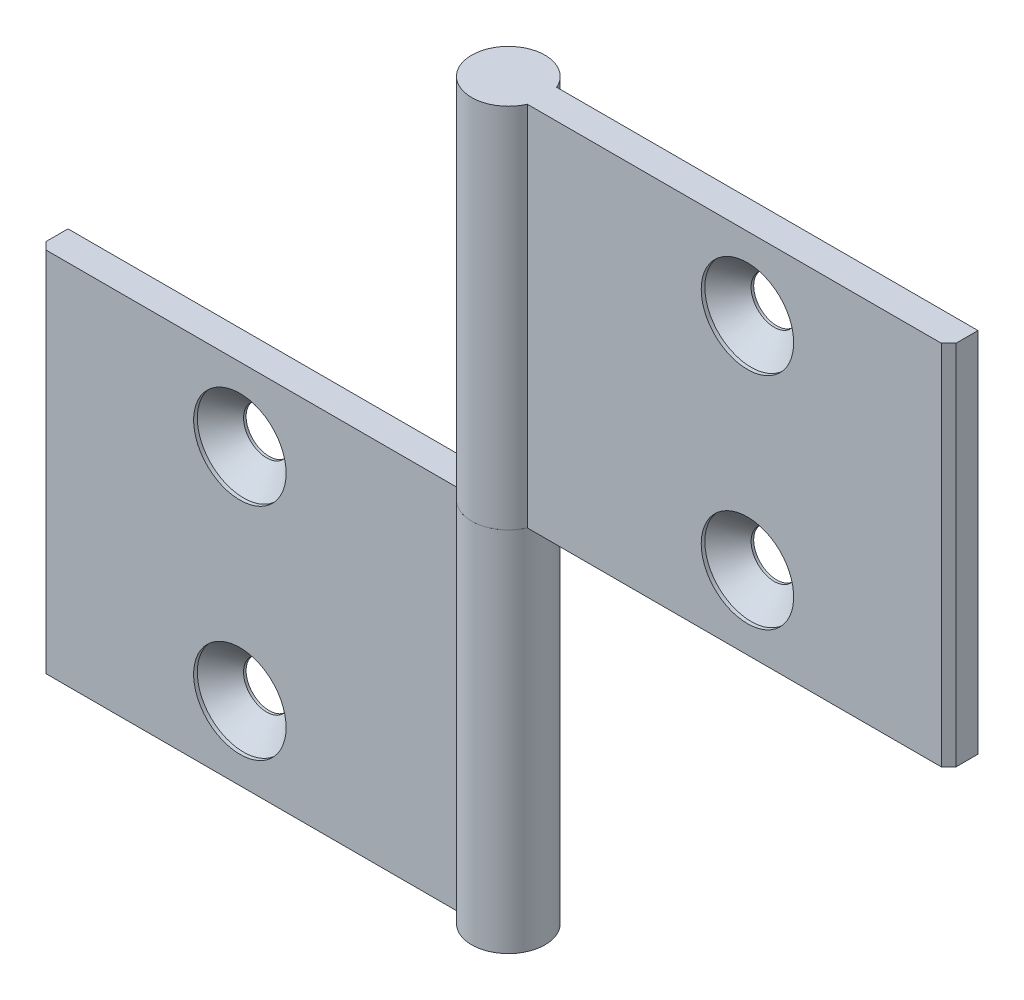
ISO-10303-21;
HEADER;
FILE_DESCRIPTION(('STEP AP214'),'2;1');
FILE_NAME('part.step','',(''),(''),'','','');
FILE_SCHEMA(('AUTOMOTIVE_DESIGN { 1 0 10303 214 1 1 1 1 }'));
ENDSEC;
DATA;
#1=APPLICATION_CONTEXT('core data for automotive mechanical design processes');
#2=APPLICATION_PROTOCOL_DEFINITION('international standard','automotive_design',2000,#1);
#3=PRODUCT_CONTEXT('',#1,'mechanical');
#4=PRODUCT('Part','Part','',(#3));
#5=PRODUCT_RELATED_PRODUCT_CATEGORY('part','',(#4));
#6=PRODUCT_DEFINITION_FORMATION('','',#4);
#7=PRODUCT_DEFINITION_CONTEXT('part definition',#1,'design');
#8=PRODUCT_DEFINITION('design','',#6,#7);
#9=PRODUCT_DEFINITION_SHAPE('','',#8);
#10=(LENGTH_UNIT() NAMED_UNIT(*) SI_UNIT(.MILLI.,.METRE.));
#11=(NAMED_UNIT(*) PLANE_ANGLE_UNIT() SI_UNIT($,.RADIAN.));
#12=(NAMED_UNIT(*) SI_UNIT($,.STERADIAN.) SOLID_ANGLE_UNIT());
#13=UNCERTAINTY_MEASURE_WITH_UNIT(LENGTH_MEASURE(1.E-05),#10,'distance_accuracy_value','');
#14=(GEOMETRIC_REPRESENTATION_CONTEXT(3) GLOBAL_UNCERTAINTY_ASSIGNED_CONTEXT((#13)) GLOBAL_UNIT_ASSIGNED_CONTEXT((#10,
#11,#12)) REPRESENTATION_CONTEXT('',''));
#15=CARTESIAN_POINT('',(0.,0.,0.));
#16=DIRECTION('',(0.,0.,1.));
#17=DIRECTION('',(1.,0.,0.));
#18=AXIS2_PLACEMENT_3D('',#15,#16,#17);
#19=CARTESIAN_POINT('',(0.,25.,0.));
#20=DIRECTION('',(0.,1.,0.));
#21=DIRECTION('',(0.,0.,-1.));
#22=AXIS2_PLACEMENT_3D('',#19,#20,#21);
#23=CYLINDRICAL_SURFACE('',#22,5.);
#24=CARTESIAN_POINT('',(0.,75.,0.));
#25=DIRECTION('',(0.,-1.,0.));
#26=DIRECTION('',(0.,0.,1.));
#27=AXIS2_PLACEMENT_3D('',#24,#25,#26);
#28=CIRCLE('',#27,5.);
#29=CARTESIAN_POINT('',(4.58257569495585,75.,1.99999999999997));
#30=VERTEX_POINT('',#29);
#31=CARTESIAN_POINT('',(4.58257569495582,75.,-2.00000000000004));
#32=VERTEX_POINT('',#31);
#33=EDGE_CURVE('E120',#30,#32,#28,.T.);
#34=ORIENTED_EDGE('',*,*,#33,.T.);
#35=DIRECTION('',(0.,1.,0.));
#36=VECTOR('',#35,1.);
#37=CARTESIAN_POINT('',(4.58257569495582,25.,-2.00000000000004));
#38=LINE('',#37,#36);
#39=CARTESIAN_POINT('',(4.58257569495582,25.,-2.00000000000004));
#40=VERTEX_POINT('',#39);
#41=EDGE_CURVE('E12',#40,#32,#38,.T.);
#42=ORIENTED_EDGE('',*,*,#41,.F.);
#43=CARTESIAN_POINT('',(0.,25.,0.));
#44=DIRECTION('',(0.,-1.,0.));
#45=DIRECTION('',(0.,0.,1.));
#46=AXIS2_PLACEMENT_3D('',#43,#44,#45);
#47=CIRCLE('',#46,5.);
#48=CARTESIAN_POINT('',(4.58257569495585,25.,1.99999999999997));
#49=VERTEX_POINT('',#48);
#50=EDGE_CURVE('E129',#49,#40,#47,.T.);
#51=ORIENTED_EDGE('',*,*,#50,.F.);
#52=DIRECTION('',(0.,1.,0.));
#53=VECTOR('',#52,1.);
#54=CARTESIAN_POINT('',(4.58257569495585,25.,1.99999999999997));
#55=LINE('',#54,#53);
#56=EDGE_CURVE('E116',#49,#30,#55,.T.);
#57=ORIENTED_EDGE('',*,*,#56,.T.);
#58=EDGE_LOOP('',(#34,#42,#51,#57));
#59=FACE_BOUND('',#58,.T.);
#60=ADVANCED_FACE('F44',(#59),#23,.T.);
#61=CARTESIAN_POINT('',(4.58257569495582,25.,-2.00000000000004));
#62=DIRECTION('',(0.,0.,1.));
#63=DIRECTION('',(-1.,0.,0.));
#64=AXIS2_PLACEMENT_3D('',#61,#62,#63);
#65=PLANE('',#64);
#66=CARTESIAN_POINT('',(34.5825756949558,35.,-2.00000000000025));
#67=DIRECTION('',(0.,0.,1.));
#68=DIRECTION('',(-1.,0.,0.));
#69=AXIS2_PLACEMENT_3D('',#66,#67,#68);
#70=CIRCLE('',#69,3.15);
#71=CARTESIAN_POINT('',(31.4325756949558,35.,-2.00000000000023));
#72=VERTEX_POINT('',#71);
#73=EDGE_CURVE('E47',#72,#72,#70,.T.);
#74=ORIENTED_EDGE('',*,*,#73,.T.);
#75=EDGE_LOOP('',(#74));
#76=FACE_BOUND('',#75,.T.);
#77=CARTESIAN_POINT('',(34.5825756949558,65.,-2.00000000000025));
#78=DIRECTION('',(0.,0.,1.));
#79=DIRECTION('',(-1.,0.,0.));
#80=AXIS2_PLACEMENT_3D('',#77,#78,#79);
#81=CIRCLE('',#80,3.15);
#82=CARTESIAN_POINT('',(31.4325756949558,65.,-2.00000000000023));
#83=VERTEX_POINT('',#82);
#84=EDGE_CURVE('E124',#83,#83,#81,.T.);
#85=ORIENTED_EDGE('',*,*,#84,.T.);
#86=EDGE_LOOP('',(#85));
#87=FACE_BOUND('',#86,.T.);
#88=DIRECTION('',(1.,0.,0.));
#89=VECTOR('',#88,1.);
#90=CARTESIAN_POINT('',(4.58257569495582,75.,-2.00000000000004));
#91=LINE('',#90,#89);
#92=CARTESIAN_POINT('',(62.,75.,-2.00000000000046));
#93=VERTEX_POINT('',#92);
#94=EDGE_CURVE('E123',#32,#93,#91,.T.);
#95=ORIENTED_EDGE('',*,*,#94,.T.);
#96=DIRECTION('',(0.,1.,0.));
#97=VECTOR('',#96,1.);
#98=CARTESIAN_POINT('',(62.,25.,-2.00000000000046));
#99=LINE('',#98,#97);
#100=CARTESIAN_POINT('',(62.,25.,-2.00000000000046));
#101=VERTEX_POINT('',#100);
#102=EDGE_CURVE('E53',#101,#93,#99,.T.);
#103=ORIENTED_EDGE('',*,*,#102,.F.);
#104=DIRECTION('',(1.,0.,0.));
#105=VECTOR('',#104,1.);
#106=CARTESIAN_POINT('',(4.58257569495582,25.,-2.00000000000004));
#107=LINE('',#106,#105);
#108=EDGE_CURVE('E96',#40,#101,#107,.T.);
#109=ORIENTED_EDGE('',*,*,#108,.F.);
#110=ORIENTED_EDGE('',*,*,#41,.T.);
#111=EDGE_LOOP('',(#95,#103,#109,#110));
#112=FACE_BOUND('',#111,.T.);
#113=ADVANCED_FACE('F150',(#76,#87,#112),#65,.F.);
#114=CARTESIAN_POINT('',(62.,25.,-2.00000000000046));
#115=DIRECTION('',(-1.,0.,0.));
#116=DIRECTION('',(0.,0.,-1.));
#117=AXIS2_PLACEMENT_3D('',#114,#115,#116);
#118=PLANE('',#117);
#119=DIRECTION('',(0.,0.,1.));
#120=VECTOR('',#119,1.);
#121=CARTESIAN_POINT('',(62.,75.,-2.00000000000046));
#122=LINE('',#121,#120);
#123=CARTESIAN_POINT('',(62.,75.,0.999999999999544));
#124=VERTEX_POINT('',#123);
#125=EDGE_CURVE('E111',#93,#124,#122,.T.);
#126=ORIENTED_EDGE('',*,*,#125,.T.);
#127=DIRECTION('',(0.,1.,0.));
#128=VECTOR('',#127,1.);
#129=CARTESIAN_POINT('',(62.,25.,0.999999999999544));
#130=LINE('',#129,#128);
#131=CARTESIAN_POINT('',(62.,25.,0.999999999999544));
#132=VERTEX_POINT('',#131);
#133=EDGE_CURVE('E108',#132,#124,#130,.T.);
#134=ORIENTED_EDGE('',*,*,#133,.F.);
#135=DIRECTION('',(0.,0.,1.));
#136=VECTOR('',#135,1.);
#137=CARTESIAN_POINT('',(62.,25.,-2.00000000000046));
#138=LINE('',#137,#136);
#139=EDGE_CURVE('E100',#101,#132,#138,.T.);
#140=ORIENTED_EDGE('',*,*,#139,.F.);
#141=ORIENTED_EDGE('',*,*,#102,.T.);
#142=EDGE_LOOP('',(#126,#134,#140,#141));
#143=FACE_BOUND('',#142,.T.);
#144=ADVANCED_FACE('F109',(#143),#118,.F.);
#145=CARTESIAN_POINT('',(62.,25.,0.999999999999544));
#146=DIRECTION('',(-0.707106781186548,0.,-0.707106781186548));
#147=DIRECTION('',(0.707106781186548,0.,-0.707106781186548));
#148=AXIS2_PLACEMENT_3D('',#145,#146,#147);
#149=PLANE('',#148);
#150=DIRECTION('',(-0.707106781186548,0.,0.707106781186548));
#151=VECTOR('',#150,1.);
#152=CARTESIAN_POINT('',(62.,75.,0.999999999999544));
#153=LINE('',#152,#151);
#154=CARTESIAN_POINT('',(61.,75.,1.99999999999954));
#155=VERTEX_POINT('',#154);
#156=EDGE_CURVE('E82',#124,#155,#153,.T.);
#157=ORIENTED_EDGE('',*,*,#156,.T.);
#158=DIRECTION('',(0.,1.,0.));
#159=VECTOR('',#158,1.);
#160=CARTESIAN_POINT('',(61.,25.,1.99999999999954));
#161=LINE('',#160,#159);
#162=CARTESIAN_POINT('',(61.,25.,1.99999999999954));
#163=VERTEX_POINT('',#162);
#164=EDGE_CURVE('E112',#163,#155,#161,.T.);
#165=ORIENTED_EDGE('',*,*,#164,.F.);
#166=DIRECTION('',(-0.707106781186548,0.,0.707106781186548));
#167=VECTOR('',#166,1.);
#168=CARTESIAN_POINT('',(62.,25.,0.999999999999544));
#169=LINE('',#168,#167);
#170=EDGE_CURVE('E104',#132,#163,#169,.T.);
#171=ORIENTED_EDGE('',*,*,#170,.F.);
#172=ORIENTED_EDGE('',*,*,#133,.T.);
#173=EDGE_LOOP('',(#157,#165,#171,#172));
#174=FACE_BOUND('',#173,.T.);
#175=ADVANCED_FACE('F114',(#174),#149,.F.);
#176=CARTESIAN_POINT('',(61.,25.,1.99999999999954));
#177=DIRECTION('',(0.,0.,-1.));
#178=DIRECTION('',(1.,0.,0.));
#179=AXIS2_PLACEMENT_3D('',#176,#177,#178);
#180=PLANE('',#179);
#181=CARTESIAN_POINT('',(34.5825756949558,35.,1.99999999999974));
#182=DIRECTION('',(0.,0.,1.));
#183=DIRECTION('',(-1.,0.,0.));
#184=AXIS2_PLACEMENT_3D('',#181,#182,#183);
#185=CIRCLE('',#184,6.3);
#186=CARTESIAN_POINT('',(28.2825756949558,35.,1.99999999999979));
#187=VERTEX_POINT('',#186);
#188=EDGE_CURVE('E184',#187,#187,#185,.T.);
#189=ORIENTED_EDGE('',*,*,#188,.F.);
#190=EDGE_LOOP('',(#189));
#191=FACE_BOUND('',#190,.T.);
#192=CARTESIAN_POINT('',(34.5825756949558,65.,1.99999999999974));
#193=DIRECTION('',(0.,0.,1.));
#194=DIRECTION('',(-1.,0.,0.));
#195=AXIS2_PLACEMENT_3D('',#192,#193,#194);
#196=CIRCLE('',#195,6.3);
#197=CARTESIAN_POINT('',(28.2825756949558,65.,1.99999999999979));
#198=VERTEX_POINT('',#197);
#199=EDGE_CURVE('E142',#198,#198,#196,.T.);
#200=ORIENTED_EDGE('',*,*,#199,.F.);
#201=EDGE_LOOP('',(#200));
#202=FACE_BOUND('',#201,.T.);
#203=DIRECTION('',(-1.,0.,0.));
#204=VECTOR('',#203,1.);
#205=CARTESIAN_POINT('',(61.,75.,1.99999999999954));
#206=LINE('',#205,#204);
#207=EDGE_CURVE('E88',#155,#30,#206,.T.);
#208=ORIENTED_EDGE('',*,*,#207,.T.);
#209=ORIENTED_EDGE('',*,*,#56,.F.);
#210=DIRECTION('',(-1.,0.,0.));
#211=VECTOR('',#210,1.);
#212=CARTESIAN_POINT('',(61.,25.,1.99999999999954));
#213=LINE('',#212,#211);
#214=EDGE_CURVE('E62',#163,#49,#213,.T.);
#215=ORIENTED_EDGE('',*,*,#214,.F.);
#216=ORIENTED_EDGE('',*,*,#164,.T.);
#217=EDGE_LOOP('',(#208,#209,#215,#216));
#218=FACE_BOUND('',#217,.T.);
#219=ADVANCED_FACE('F162',(#191,#202,#218),#180,.F.);
#220=CARTESIAN_POINT('',(0.,25.,0.));
#221=DIRECTION('',(0.,-1.,0.));
#222=DIRECTION('',(0.,0.,1.));
#223=AXIS2_PLACEMENT_3D('',#220,#221,#222);
#224=PLANE('',#223);
#225=ORIENTED_EDGE('',*,*,#50,.T.);
#226=ORIENTED_EDGE('',*,*,#108,.T.);
#227=ORIENTED_EDGE('',*,*,#139,.T.);
#228=ORIENTED_EDGE('',*,*,#170,.T.);
#229=ORIENTED_EDGE('',*,*,#214,.T.);
#230=EDGE_LOOP('',(#225,#226,#227,#228,#229));
#231=FACE_BOUND('',#230,.T.);
#232=ADVANCED_FACE('F102',(#231),#224,.T.);
#233=CARTESIAN_POINT('',(0.,75.,0.));
#234=DIRECTION('',(0.,-1.,0.));
#235=DIRECTION('',(0.,0.,1.));
#236=AXIS2_PLACEMENT_3D('',#233,#234,#235);
#237=PLANE('',#236);
#238=ORIENTED_EDGE('',*,*,#33,.F.);
#239=ORIENTED_EDGE('',*,*,#207,.F.);
#240=ORIENTED_EDGE('',*,*,#156,.F.);
#241=ORIENTED_EDGE('',*,*,#125,.F.);
#242=ORIENTED_EDGE('',*,*,#94,.F.);
#243=EDGE_LOOP('',(#238,#239,#240,#241,#242));
#244=FACE_BOUND('',#243,.T.);
#245=ADVANCED_FACE('F152',(#244),#237,.F.);
#246=CARTESIAN_POINT('',(34.5825756949558,65.,1.99999999999974));
#247=DIRECTION('',(0.,0.,1.));
#248=DIRECTION('',(-1.,0.,0.));
#249=AXIS2_PLACEMENT_3D('',#246,#247,#248);
#250=CYLINDRICAL_SURFACE('',#249,3.15);
#251=CARTESIAN_POINT('',(34.5825756949558,65.,-1.65000000000026));
#252=DIRECTION('',(0.,0.,1.));
#253=DIRECTION('',(-1.,0.,0.));
#254=AXIS2_PLACEMENT_3D('',#251,#252,#253);
#255=CIRCLE('',#254,3.15);
#256=CARTESIAN_POINT('',(31.4325756949558,65.,-1.65000000000023));
#257=VERTEX_POINT('',#256);
#258=EDGE_CURVE('E133',#257,#257,#255,.T.);
#259=ORIENTED_EDGE('',*,*,#258,.T.);
#260=EDGE_LOOP('',(#259));
#261=FACE_BOUND('',#260,.T.);
#262=ORIENTED_EDGE('',*,*,#84,.F.);
#263=EDGE_LOOP('',(#262));
#264=FACE_BOUND('',#263,.T.);
#265=ADVANCED_FACE('F154',(#261,#264),#250,.F.);
#266=CARTESIAN_POINT('',(34.5825756949558,65.,1.49999999999974));
#267=DIRECTION('',(0.,0.,1.));
#268=DIRECTION('',(-1.,0.,0.));
#269=AXIS2_PLACEMENT_3D('',#266,#267,#268);
#270=CONICAL_SURFACE('',#269,6.3,0.785398163397449);
#271=ORIENTED_EDGE('',*,*,#258,.F.);
#272=EDGE_LOOP('',(#271));
#273=FACE_BOUND('',#272,.T.);
#274=CARTESIAN_POINT('',(34.5825756949558,65.,1.49999999999974));
#275=DIRECTION('',(0.,0.,1.));
#276=DIRECTION('',(-1.,0.,0.));
#277=AXIS2_PLACEMENT_3D('',#274,#275,#276);
#278=CIRCLE('',#277,6.3);
#279=CARTESIAN_POINT('',(28.2825756949558,65.,1.49999999999979));
#280=VERTEX_POINT('',#279);
#281=EDGE_CURVE('E137',#280,#280,#278,.T.);
#282=ORIENTED_EDGE('',*,*,#281,.T.);
#283=EDGE_LOOP('',(#282));
#284=FACE_BOUND('',#283,.T.);
#285=ADVANCED_FACE('F160',(#273,#284),#270,.F.);
#286=CARTESIAN_POINT('',(34.5825756949558,65.,1.99999999999974));
#287=DIRECTION('',(0.,0.,1.));
#288=DIRECTION('',(-1.,0.,0.));
#289=AXIS2_PLACEMENT_3D('',#286,#287,#288);
#290=CYLINDRICAL_SURFACE('',#289,6.3);
#291=ORIENTED_EDGE('',*,*,#281,.F.);
#292=EDGE_LOOP('',(#291));
#293=FACE_BOUND('',#292,.T.);
#294=ORIENTED_EDGE('',*,*,#199,.T.);
#295=EDGE_LOOP('',(#294));
#296=FACE_BOUND('',#295,.T.);
#297=ADVANCED_FACE('F211',(#293,#296),#290,.F.);
#298=CARTESIAN_POINT('',(34.5825756949558,35.,1.99999999999974));
#299=DIRECTION('',(0.,0.,1.));
#300=DIRECTION('',(-1.,0.,0.));
#301=AXIS2_PLACEMENT_3D('',#298,#299,#300);
#302=CYLINDRICAL_SURFACE('',#301,3.15);
#303=CARTESIAN_POINT('',(34.5825756949558,35.,-1.65000000000026));
#304=DIRECTION('',(0.,0.,1.));
#305=DIRECTION('',(-1.,0.,0.));
#306=AXIS2_PLACEMENT_3D('',#303,#304,#305);
#307=CIRCLE('',#306,3.15);
#308=CARTESIAN_POINT('',(31.4325756949558,35.,-1.65000000000023));
#309=VERTEX_POINT('',#308);
#310=EDGE_CURVE('E188',#309,#309,#307,.T.);
#311=ORIENTED_EDGE('',*,*,#310,.T.);
#312=EDGE_LOOP('',(#311));
#313=FACE_BOUND('',#312,.T.);
#314=ORIENTED_EDGE('',*,*,#73,.F.);
#315=EDGE_LOOP('',(#314));
#316=FACE_BOUND('',#315,.T.);
#317=ADVANCED_FACE('F204',(#313,#316),#302,.F.);
#318=CARTESIAN_POINT('',(34.5825756949558,35.,1.49999999999974));
#319=DIRECTION('',(0.,0.,1.));
#320=DIRECTION('',(-1.,0.,0.));
#321=AXIS2_PLACEMENT_3D('',#318,#319,#320);
#322=CONICAL_SURFACE('',#321,6.3,0.785398163397449);
#323=ORIENTED_EDGE('',*,*,#310,.F.);
#324=EDGE_LOOP('',(#323));
#325=FACE_BOUND('',#324,.T.);
#326=CARTESIAN_POINT('',(34.5825756949558,35.,1.49999999999974));
#327=DIRECTION('',(0.,0.,1.));
#328=DIRECTION('',(-1.,0.,0.));
#329=AXIS2_PLACEMENT_3D('',#326,#327,#328);
#330=CIRCLE('',#329,6.3);
#331=CARTESIAN_POINT('',(28.2825756949558,35.,1.49999999999979));
#332=VERTEX_POINT('',#331);
#333=EDGE_CURVE('E192',#332,#332,#330,.T.);
#334=ORIENTED_EDGE('',*,*,#333,.T.);
#335=EDGE_LOOP('',(#334));
#336=FACE_BOUND('',#335,.T.);
#337=ADVANCED_FACE('F198',(#325,#336),#322,.F.);
#338=CARTESIAN_POINT('',(34.5825756949558,35.,1.99999999999974));
#339=DIRECTION('',(0.,0.,1.));
#340=DIRECTION('',(-1.,0.,0.));
#341=AXIS2_PLACEMENT_3D('',#338,#339,#340);
#342=CYLINDRICAL_SURFACE('',#341,6.3);
#343=ORIENTED_EDGE('',*,*,#333,.F.);
#344=EDGE_LOOP('',(#343));
#345=FACE_BOUND('',#344,.T.);
#346=ORIENTED_EDGE('',*,*,#188,.T.);
#347=EDGE_LOOP('',(#346));
#348=FACE_BOUND('',#347,.T.);
#349=ADVANCED_FACE('F196',(#345,#348),#342,.F.);
#350=CLOSED_SHELL('',(#60,#113,#144,#175,#219,#232,#245,#265,#285,#297,#317,#337,#349));
#351=MANIFOLD_SOLID_BREP('B2',#350);
#352=CARTESIAN_POINT('',(0.,25.,0.));
#353=DIRECTION('',(0.,-1.,0.));
#354=DIRECTION('',(0.,0.,-1.));
#355=AXIS2_PLACEMENT_3D('',#352,#353,#354);
#356=CYLINDRICAL_SURFACE('',#355,5.);
#357=CARTESIAN_POINT('',(0.,-25.,0.));
#358=DIRECTION('',(0.,1.,0.));
#359=DIRECTION('',(0.,0.,1.));
#360=AXIS2_PLACEMENT_3D('',#357,#358,#359);
#361=CIRCLE('',#360,5.);
#362=CARTESIAN_POINT('',(-4.58257569495584,-25.,2.));
#363=VERTEX_POINT('',#362);
#364=CARTESIAN_POINT('',(-4.58257569495584,-25.,-2.));
#365=VERTEX_POINT('',#364);
#366=EDGE_CURVE('E371',#363,#365,#361,.T.);
#367=ORIENTED_EDGE('',*,*,#366,.T.);
#368=DIRECTION('',(0.,-1.,0.));
#369=VECTOR('',#368,1.);
#370=CARTESIAN_POINT('',(-4.58257569495584,25.,-2.));
#371=LINE('',#370,#369);
#372=CARTESIAN_POINT('',(-4.58257569495584,25.,-2.));
#373=VERTEX_POINT('',#372);
#374=EDGE_CURVE('E42',#373,#365,#371,.T.);
#375=ORIENTED_EDGE('',*,*,#374,.F.);
#376=CARTESIAN_POINT('',(0.,25.,0.));
#377=DIRECTION('',(0.,1.,0.));
#378=DIRECTION('',(0.,0.,1.));
#379=AXIS2_PLACEMENT_3D('',#376,#377,#378);
#380=CIRCLE('',#379,5.);
#381=CARTESIAN_POINT('',(-4.58257569495584,25.,2.));
#382=VERTEX_POINT('',#381);
#383=EDGE_CURVE('E380',#382,#373,#380,.T.);
#384=ORIENTED_EDGE('',*,*,#383,.F.);
#385=DIRECTION('',(0.,-1.,0.));
#386=VECTOR('',#385,1.);
#387=CARTESIAN_POINT('',(-4.58257569495584,25.,2.));
#388=LINE('',#387,#386);
#389=EDGE_CURVE('E367',#382,#363,#388,.T.);
#390=ORIENTED_EDGE('',*,*,#389,.T.);
#391=EDGE_LOOP('',(#367,#375,#384,#390));
#392=FACE_BOUND('',#391,.T.);
#393=ADVANCED_FACE('F295',(#392),#356,.T.);
#394=CARTESIAN_POINT('',(-4.58257569495584,25.,-2.));
#395=DIRECTION('',(0.,0.,1.));
#396=DIRECTION('',(1.,0.,0.));
#397=AXIS2_PLACEMENT_3D('',#394,#395,#396);
#398=PLANE('',#397);
#399=CARTESIAN_POINT('',(-34.5825756949558,15.,-2.));
#400=DIRECTION('',(0.,0.,1.));
#401=DIRECTION('',(1.,0.,0.));
#402=AXIS2_PLACEMENT_3D('',#399,#400,#401);
#403=CIRCLE('',#402,3.15);
#404=CARTESIAN_POINT('',(-31.4325756949558,15.,-2.));
#405=VERTEX_POINT('',#404);
#406=EDGE_CURVE('E298',#405,#405,#403,.T.);
#407=ORIENTED_EDGE('',*,*,#406,.T.);
#408=EDGE_LOOP('',(#407));
#409=FACE_BOUND('',#408,.T.);
#410=CARTESIAN_POINT('',(-34.5825756949558,-15.,-2.));
#411=DIRECTION('',(0.,0.,1.));
#412=DIRECTION('',(1.,0.,0.));
#413=AXIS2_PLACEMENT_3D('',#410,#411,#412);
#414=CIRCLE('',#413,3.15);
#415=CARTESIAN_POINT('',(-31.4325756949558,-15.,-2.));
#416=VERTEX_POINT('',#415);
#417=EDGE_CURVE('E375',#416,#416,#414,.T.);
#418=ORIENTED_EDGE('',*,*,#417,.T.);
#419=EDGE_LOOP('',(#418));
#420=FACE_BOUND('',#419,.T.);
#421=DIRECTION('',(-1.,0.,0.));
#422=VECTOR('',#421,1.);
#423=CARTESIAN_POINT('',(-4.58257569495584,-25.,-2.));
#424=LINE('',#423,#422);
#425=CARTESIAN_POINT('',(-62.,-25.,-1.99999999999999));
#426=VERTEX_POINT('',#425);
#427=EDGE_CURVE('E374',#365,#426,#424,.T.);
#428=ORIENTED_EDGE('',*,*,#427,.T.);
#429=DIRECTION('',(0.,-1.,0.));
#430=VECTOR('',#429,1.);
#431=CARTESIAN_POINT('',(-62.,25.,-1.99999999999999));
#432=LINE('',#431,#430);
#433=CARTESIAN_POINT('',(-62.,25.,-1.99999999999999));
#434=VERTEX_POINT('',#433);
#435=EDGE_CURVE('E304',#434,#426,#432,.T.);
#436=ORIENTED_EDGE('',*,*,#435,.F.);
#437=DIRECTION('',(-1.,0.,0.));
#438=VECTOR('',#437,1.);
#439=CARTESIAN_POINT('',(-4.58257569495584,25.,-2.));
#440=LINE('',#439,#438);
#441=EDGE_CURVE('E347',#373,#434,#440,.T.);
#442=ORIENTED_EDGE('',*,*,#441,.F.);
#443=ORIENTED_EDGE('',*,*,#374,.T.);
#444=EDGE_LOOP('',(#428,#436,#442,#443));
#445=FACE_BOUND('',#444,.T.);
#446=ADVANCED_FACE('F401',(#409,#420,#445),#398,.F.);
#447=CARTESIAN_POINT('',(-62.,25.,-1.99999999999999));
#448=DIRECTION('',(1.,0.,0.));
#449=DIRECTION('',(0.,0.,-1.));
#450=AXIS2_PLACEMENT_3D('',#447,#448,#449);
#451=PLANE('',#450);
#452=DIRECTION('',(0.,0.,1.));
#453=VECTOR('',#452,1.);
#454=CARTESIAN_POINT('',(-62.,-25.,-1.99999999999999));
#455=LINE('',#454,#453);
#456=CARTESIAN_POINT('',(-62.,-25.,1.00000000000001));
#457=VERTEX_POINT('',#456);
#458=EDGE_CURVE('E362',#426,#457,#455,.T.);
#459=ORIENTED_EDGE('',*,*,#458,.T.);
#460=DIRECTION('',(0.,-1.,0.));
#461=VECTOR('',#460,1.);
#462=CARTESIAN_POINT('',(-62.,25.,1.00000000000001));
#463=LINE('',#462,#461);
#464=CARTESIAN_POINT('',(-62.,25.,1.00000000000001));
#465=VERTEX_POINT('',#464);
#466=EDGE_CURVE('E359',#465,#457,#463,.T.);
#467=ORIENTED_EDGE('',*,*,#466,.F.);
#468=DIRECTION('',(0.,0.,1.));
#469=VECTOR('',#468,1.);
#470=CARTESIAN_POINT('',(-62.,25.,-1.99999999999999));
#471=LINE('',#470,#469);
#472=EDGE_CURVE('E351',#434,#465,#471,.T.);
#473=ORIENTED_EDGE('',*,*,#472,.F.);
#474=ORIENTED_EDGE('',*,*,#435,.T.);
#475=EDGE_LOOP('',(#459,#467,#473,#474));
#476=FACE_BOUND('',#475,.T.);
#477=ADVANCED_FACE('F360',(#476),#451,.F.);
#478=CARTESIAN_POINT('',(-62.,25.,1.00000000000001));
#479=DIRECTION('',(0.707106781186542,0.,-0.707106781186553));
#480=DIRECTION('',(-0.707106781186553,0.,-0.707106781186542));
#481=AXIS2_PLACEMENT_3D('',#478,#479,#480);
#482=PLANE('',#481);
#483=DIRECTION('',(0.707106781186553,0.,0.707106781186542));
#484=VECTOR('',#483,1.);
#485=CARTESIAN_POINT('',(-62.,-25.,1.00000000000001));
#486=LINE('',#485,#484);
#487=CARTESIAN_POINT('',(-61.,-25.,1.99999999999999));
#488=VERTEX_POINT('',#487);
#489=EDGE_CURVE('E333',#457,#488,#486,.T.);
#490=ORIENTED_EDGE('',*,*,#489,.T.);
#491=DIRECTION('',(0.,-1.,0.));
#492=VECTOR('',#491,1.);
#493=CARTESIAN_POINT('',(-61.,25.,1.99999999999999));
#494=LINE('',#493,#492);
#495=CARTESIAN_POINT('',(-61.,25.,1.99999999999999));
#496=VERTEX_POINT('',#495);
#497=EDGE_CURVE('E363',#496,#488,#494,.T.);
#498=ORIENTED_EDGE('',*,*,#497,.F.);
#499=DIRECTION('',(0.707106781186553,0.,0.707106781186542));
#500=VECTOR('',#499,1.);
#501=CARTESIAN_POINT('',(-62.,25.,1.00000000000001));
#502=LINE('',#501,#500);
#503=EDGE_CURVE('E355',#465,#496,#502,.T.);
#504=ORIENTED_EDGE('',*,*,#503,.F.);
#505=ORIENTED_EDGE('',*,*,#466,.T.);
#506=EDGE_LOOP('',(#490,#498,#504,#505));
#507=FACE_BOUND('',#506,.T.);
#508=ADVANCED_FACE('F365',(#507),#482,.F.);
#509=CARTESIAN_POINT('',(-61.,25.,1.99999999999999));
#510=DIRECTION('',(0.,0.,-1.));
#511=DIRECTION('',(-1.,0.,0.));
#512=AXIS2_PLACEMENT_3D('',#509,#510,#511);
#513=PLANE('',#512);
#514=CARTESIAN_POINT('',(-34.5825756949558,15.,2.));
#515=DIRECTION('',(0.,0.,1.));
#516=DIRECTION('',(1.,0.,0.));
#517=AXIS2_PLACEMENT_3D('',#514,#515,#516);
#518=CIRCLE('',#517,6.3);
#519=CARTESIAN_POINT('',(-28.2825756949558,15.,2.));
#520=VERTEX_POINT('',#519);
#521=EDGE_CURVE('E435',#520,#520,#518,.T.);
#522=ORIENTED_EDGE('',*,*,#521,.F.);
#523=EDGE_LOOP('',(#522));
#524=FACE_BOUND('',#523,.T.);
#525=CARTESIAN_POINT('',(-34.5825756949558,-15.,2.));
#526=DIRECTION('',(0.,0.,1.));
#527=DIRECTION('',(1.,0.,0.));
#528=AXIS2_PLACEMENT_3D('',#525,#526,#527);
#529=CIRCLE('',#528,6.3);
#530=CARTESIAN_POINT('',(-28.2825756949558,-15.,2.));
#531=VERTEX_POINT('',#530);
#532=EDGE_CURVE('E393',#531,#531,#529,.T.);
#533=ORIENTED_EDGE('',*,*,#532,.F.);
#534=EDGE_LOOP('',(#533));
#535=FACE_BOUND('',#534,.T.);
#536=DIRECTION('',(1.,0.,0.));
#537=VECTOR('',#536,1.);
#538=CARTESIAN_POINT('',(-61.,-25.,1.99999999999999));
#539=LINE('',#538,#537);
#540=EDGE_CURVE('E339',#488,#363,#539,.T.);
#541=ORIENTED_EDGE('',*,*,#540,.T.);
#542=ORIENTED_EDGE('',*,*,#389,.F.);
#543=DIRECTION('',(1.,0.,0.));
#544=VECTOR('',#543,1.);
#545=CARTESIAN_POINT('',(-61.,25.,1.99999999999999));
#546=LINE('',#545,#544);
#547=EDGE_CURVE('E313',#496,#382,#546,.T.);
#548=ORIENTED_EDGE('',*,*,#547,.F.);
#549=ORIENTED_EDGE('',*,*,#497,.T.);
#550=EDGE_LOOP('',(#541,#542,#548,#549));
#551=FACE_BOUND('',#550,.T.);
#552=ADVANCED_FACE('F413',(#524,#535,#551),#513,.F.);
#553=CARTESIAN_POINT('',(0.,25.,0.));
#554=DIRECTION('',(0.,1.,0.));
#555=DIRECTION('',(0.,0.,1.));
#556=AXIS2_PLACEMENT_3D('',#553,#554,#555);
#557=PLANE('',#556);
#558=ORIENTED_EDGE('',*,*,#383,.T.);
#559=ORIENTED_EDGE('',*,*,#441,.T.);
#560=ORIENTED_EDGE('',*,*,#472,.T.);
#561=ORIENTED_EDGE('',*,*,#503,.T.);
#562=ORIENTED_EDGE('',*,*,#547,.T.);
#563=EDGE_LOOP('',(#558,#559,#560,#561,#562));
#564=FACE_BOUND('',#563,.T.);
#565=ADVANCED_FACE('F353',(#564),#557,.T.);
#566=CARTESIAN_POINT('',(0.,-25.,0.));
#567=DIRECTION('',(0.,1.,0.));
#568=DIRECTION('',(0.,0.,1.));
#569=AXIS2_PLACEMENT_3D('',#566,#567,#568);
#570=PLANE('',#569);
#571=ORIENTED_EDGE('',*,*,#366,.F.);
#572=ORIENTED_EDGE('',*,*,#540,.F.);
#573=ORIENTED_EDGE('',*,*,#489,.F.);
#574=ORIENTED_EDGE('',*,*,#458,.F.);
#575=ORIENTED_EDGE('',*,*,#427,.F.);
#576=EDGE_LOOP('',(#571,#572,#573,#574,#575));
#577=FACE_BOUND('',#576,.T.);
#578=ADVANCED_FACE('F403',(#577),#570,.F.);
#579=CARTESIAN_POINT('',(-34.5825756949558,-15.,2.));
#580=DIRECTION('',(0.,0.,1.));
#581=DIRECTION('',(1.,0.,0.));
#582=AXIS2_PLACEMENT_3D('',#579,#580,#581);
#583=CYLINDRICAL_SURFACE('',#582,3.15);
#584=CARTESIAN_POINT('',(-34.5825756949558,-15.,-1.65));
#585=DIRECTION('',(0.,0.,1.));
#586=DIRECTION('',(1.,0.,0.));
#587=AXIS2_PLACEMENT_3D('',#584,#585,#586);
#588=CIRCLE('',#587,3.15);
#589=CARTESIAN_POINT('',(-31.4325756949558,-15.,-1.65));
#590=VERTEX_POINT('',#589);
#591=EDGE_CURVE('E384',#590,#590,#588,.T.);
#592=ORIENTED_EDGE('',*,*,#591,.T.);
#593=EDGE_LOOP('',(#592));
#594=FACE_BOUND('',#593,.T.);
#595=ORIENTED_EDGE('',*,*,#417,.F.);
#596=EDGE_LOOP('',(#595));
#597=FACE_BOUND('',#596,.T.);
#598=ADVANCED_FACE('F405',(#594,#597),#583,.F.);
#599=CARTESIAN_POINT('',(-34.5825756949558,-15.,1.5));
#600=DIRECTION('',(0.,0.,1.));
#601=DIRECTION('',(1.,0.,0.));
#602=AXIS2_PLACEMENT_3D('',#599,#600,#601);
#603=CONICAL_SURFACE('',#602,6.3,0.785398163397449);
#604=ORIENTED_EDGE('',*,*,#591,.F.);
#605=EDGE_LOOP('',(#604));
#606=FACE_BOUND('',#605,.T.);
#607=CARTESIAN_POINT('',(-34.5825756949558,-15.,1.5));
#608=DIRECTION('',(0.,0.,1.));
#609=DIRECTION('',(1.,0.,0.));
#610=AXIS2_PLACEMENT_3D('',#607,#608,#609);
#611=CIRCLE('',#610,6.3);
#612=CARTESIAN_POINT('',(-28.2825756949558,-15.,1.5));
#613=VERTEX_POINT('',#612);
#614=EDGE_CURVE('E388',#613,#613,#611,.T.);
#615=ORIENTED_EDGE('',*,*,#614,.T.);
#616=EDGE_LOOP('',(#615));
#617=FACE_BOUND('',#616,.T.);
#618=ADVANCED_FACE('F411',(#606,#617),#603,.F.);
#619=CARTESIAN_POINT('',(-34.5825756949558,-15.,2.));
#620=DIRECTION('',(0.,0.,1.));
#621=DIRECTION('',(1.,0.,0.));
#622=AXIS2_PLACEMENT_3D('',#619,#620,#621);
#623=CYLINDRICAL_SURFACE('',#622,6.3);
#624=ORIENTED_EDGE('',*,*,#614,.F.);
#625=EDGE_LOOP('',(#624));
#626=FACE_BOUND('',#625,.T.);
#627=ORIENTED_EDGE('',*,*,#532,.T.);
#628=EDGE_LOOP('',(#627));
#629=FACE_BOUND('',#628,.T.);
#630=ADVANCED_FACE('F462',(#626,#629),#623,.F.);
#631=CARTESIAN_POINT('',(-34.5825756949558,15.,2.));
#632=DIRECTION('',(0.,0.,1.));
#633=DIRECTION('',(1.,0.,0.));
#634=AXIS2_PLACEMENT_3D('',#631,#632,#633);
#635=CYLINDRICAL_SURFACE('',#634,3.15);
#636=CARTESIAN_POINT('',(-34.5825756949558,15.,-1.65));
#637=DIRECTION('',(0.,0.,1.));
#638=DIRECTION('',(1.,0.,0.));
#639=AXIS2_PLACEMENT_3D('',#636,#637,#638);
#640=CIRCLE('',#639,3.15);
#641=CARTESIAN_POINT('',(-31.4325756949558,15.,-1.65));
#642=VERTEX_POINT('',#641);
#643=EDGE_CURVE('E439',#642,#642,#640,.T.);
#644=ORIENTED_EDGE('',*,*,#643,.T.);
#645=EDGE_LOOP('',(#644));
#646=FACE_BOUND('',#645,.T.);
#647=ORIENTED_EDGE('',*,*,#406,.F.);
#648=EDGE_LOOP('',(#647));
#649=FACE_BOUND('',#648,.T.);
#650=ADVANCED_FACE('F455',(#646,#649),#635,.F.);
#651=CARTESIAN_POINT('',(-34.5825756949558,15.,1.5));
#652=DIRECTION('',(0.,0.,1.));
#653=DIRECTION('',(1.,0.,0.));
#654=AXIS2_PLACEMENT_3D('',#651,#652,#653);
#655=CONICAL_SURFACE('',#654,6.3,0.785398163397449);
#656=ORIENTED_EDGE('',*,*,#643,.F.);
#657=EDGE_LOOP('',(#656));
#658=FACE_BOUND('',#657,.T.);
#659=CARTESIAN_POINT('',(-34.5825756949558,15.,1.5));
#660=DIRECTION('',(0.,0.,1.));
#661=DIRECTION('',(1.,0.,0.));
#662=AXIS2_PLACEMENT_3D('',#659,#660,#661);
#663=CIRCLE('',#662,6.3);
#664=CARTESIAN_POINT('',(-28.2825756949558,15.,1.5));
#665=VERTEX_POINT('',#664);
#666=EDGE_CURVE('E443',#665,#665,#663,.T.);
#667=ORIENTED_EDGE('',*,*,#666,.T.);
#668=EDGE_LOOP('',(#667));
#669=FACE_BOUND('',#668,.T.);
#670=ADVANCED_FACE('F449',(#658,#669),#655,.F.);
#671=CARTESIAN_POINT('',(-34.5825756949558,15.,2.));
#672=DIRECTION('',(0.,0.,1.));
#673=DIRECTION('',(1.,0.,0.));
#674=AXIS2_PLACEMENT_3D('',#671,#672,#673);
#675=CYLINDRICAL_SURFACE('',#674,6.3);
#676=ORIENTED_EDGE('',*,*,#666,.F.);
#677=EDGE_LOOP('',(#676));
#678=FACE_BOUND('',#677,.T.);
#679=ORIENTED_EDGE('',*,*,#521,.T.);
#680=EDGE_LOOP('',(#679));
#681=FACE_BOUND('',#680,.T.);
#682=ADVANCED_FACE('F447',(#678,#681),#675,.F.);
#683=CLOSED_SHELL('',(#393,#446,#477,#508,#552,#565,#578,#598,#618,#630,#650,#670,#682));
#684=MANIFOLD_SOLID_BREP('B6',#683);
#685=ADVANCED_BREP_SHAPE_REPRESENTATION('',(#18,#351,#684),#14);
#686=SHAPE_DEFINITION_REPRESENTATION(#9,#685);
ENDSEC;
END-ISO-10303-21;
